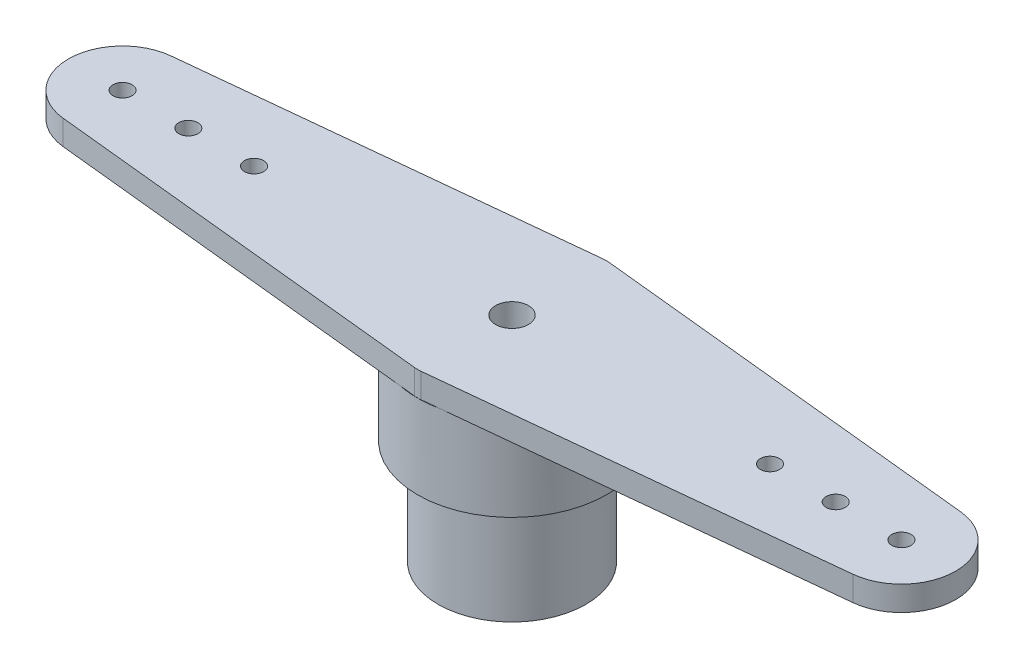
ISO-10303-21;
HEADER;
FILE_DESCRIPTION(('STEP AP214'),'2;1');
FILE_NAME('part.step','',(''),(''),'','','');
FILE_SCHEMA(('AUTOMOTIVE_DESIGN { 1 0 10303 214 1 1 1 1 }'));
ENDSEC;
DATA;
#1=APPLICATION_CONTEXT('core data for automotive mechanical design processes');
#2=APPLICATION_PROTOCOL_DEFINITION('international standard','automotive_design',2000,#1);
#3=PRODUCT_CONTEXT('',#1,'mechanical');
#4=PRODUCT('Part','Part','',(#3));
#5=PRODUCT_RELATED_PRODUCT_CATEGORY('part','',(#4));
#6=PRODUCT_DEFINITION_FORMATION('','',#4);
#7=PRODUCT_DEFINITION_CONTEXT('part definition',#1,'design');
#8=PRODUCT_DEFINITION('design','',#6,#7);
#9=PRODUCT_DEFINITION_SHAPE('','',#8);
#10=(LENGTH_UNIT() NAMED_UNIT(*) SI_UNIT(.MILLI.,.METRE.));
#11=(NAMED_UNIT(*) PLANE_ANGLE_UNIT() SI_UNIT($,.RADIAN.));
#12=(NAMED_UNIT(*) SI_UNIT($,.STERADIAN.) SOLID_ANGLE_UNIT());
#13=UNCERTAINTY_MEASURE_WITH_UNIT(LENGTH_MEASURE(1.E-05),#10,'distance_accuracy_value','');
#14=(GEOMETRIC_REPRESENTATION_CONTEXT(3) GLOBAL_UNCERTAINTY_ASSIGNED_CONTEXT((#13)) GLOBAL_UNIT_ASSIGNED_CONTEXT((#10,
#11,#12)) REPRESENTATION_CONTEXT('',''));
#15=CARTESIAN_POINT('',(0.,0.,0.));
#16=DIRECTION('',(0.,0.,1.));
#17=DIRECTION('',(1.,0.,0.));
#18=AXIS2_PLACEMENT_3D('',#15,#16,#17);
#19=CARTESIAN_POINT('',(0.,-2.55,0.));
#20=DIRECTION('',(0.,1.,0.));
#21=DIRECTION('',(0.,0.,1.));
#22=AXIS2_PLACEMENT_3D('',#19,#20,#21);
#23=PLANE('',#22);
#24=CARTESIAN_POINT('',(0.,-2.55,0.));
#25=DIRECTION('',(0.,1.,0.));
#26=DIRECTION('',(0.,0.,1.));
#27=AXIS2_PLACEMENT_3D('',#24,#25,#26);
#28=CIRCLE('',#27,2.875);
#29=CARTESIAN_POINT('',(0.,-2.55,2.875));
#30=VERTEX_POINT('',#29);
#31=EDGE_CURVE('E213',#30,#30,#28,.T.);
#32=ORIENTED_EDGE('',*,*,#31,.F.);
#33=EDGE_LOOP('',(#32));
#34=FACE_BOUND('',#33,.T.);
#35=CARTESIAN_POINT('',(0.,-2.55,0.));
#36=DIRECTION('',(0.,1.,0.));
#37=DIRECTION('',(0.,0.,1.));
#38=AXIS2_PLACEMENT_3D('',#35,#36,#37);
#39=CIRCLE('',#38,2.25);
#40=CARTESIAN_POINT('',(0.,-2.55,2.25));
#41=VERTEX_POINT('',#40);
#42=EDGE_CURVE('E220',#41,#41,#39,.F.);
#43=ORIENTED_EDGE('',*,*,#42,.F.);
#44=EDGE_LOOP('',(#43));
#45=FACE_BOUND('',#44,.T.);
#46=ADVANCED_FACE('F36',(#34,#45),#23,.F.);
#47=CARTESIAN_POINT('',(0.,0.,0.));
#48=DIRECTION('',(0.,1.,0.));
#49=DIRECTION('',(0.,0.,1.));
#50=AXIS2_PLACEMENT_3D('',#47,#48,#49);
#51=PLANE('',#50);
#52=CARTESIAN_POINT('',(0.,0.,0.));
#53=DIRECTION('',(0.,1.,0.));
#54=DIRECTION('',(0.,0.,1.));
#55=AXIS2_PLACEMENT_3D('',#52,#53,#54);
#56=CIRCLE('',#55,2.875);
#57=CARTESIAN_POINT('',(0.,0.,-2.875));
#58=VERTEX_POINT('',#57);
#59=CARTESIAN_POINT('',(-0.584049273257423,0.,-2.81505087812059));
#60=VERTEX_POINT('',#59);
#61=EDGE_CURVE('E262',#58,#60,#56,.T.);
#62=ORIENTED_EDGE('',*,*,#61,.T.);
#63=DIRECTION('',(0.994773374070749,0.,-0.102107464173283));
#64=VECTOR('',#63,1.);
#65=CARTESIAN_POINT('',(-0.292024636628711,0.,-2.84502543906029));
#66=LINE('',#65,#64);
#67=CARTESIAN_POINT('',(-0.102107464173283,0.,-2.86451928699375));
#68=VERTEX_POINT('',#67);
#69=EDGE_CURVE('E186',#60,#68,#66,.T.);
#70=ORIENTED_EDGE('',*,*,#69,.T.);
#71=CARTESIAN_POINT('',(0.,0.,-1.869745912923));
#72=DIRECTION('',(0.,1.,0.));
#73=DIRECTION('',(0.,0.,1.));
#74=AXIS2_PLACEMENT_3D('',#71,#72,#73);
#75=CIRCLE('',#74,1.);
#76=CARTESIAN_POINT('',(0.102107464173283,0.,-2.86451928699375));
#77=VERTEX_POINT('',#76);
#78=EDGE_CURVE('E11',#68,#77,#75,.F.);
#79=ORIENTED_EDGE('',*,*,#78,.T.);
#80=DIRECTION('',(-0.994773374070749,0.,-0.102107464173283));
#81=VECTOR('',#80,1.);
#82=CARTESIAN_POINT('',(0.292024636628711,0.,-2.84502543906029));
#83=LINE('',#82,#81);
#84=CARTESIAN_POINT('',(0.584049273257423,0.,-2.81505087812059));
#85=VERTEX_POINT('',#84);
#86=EDGE_CURVE('E51',#85,#77,#83,.T.);
#87=ORIENTED_EDGE('',*,*,#86,.F.);
#88=EDGE_CURVE('E264',#85,#58,#56,.T.);
#89=ORIENTED_EDGE('',*,*,#88,.T.);
#90=EDGE_LOOP('',(#62,#70,#79,#87,#89));
#91=FACE_BOUND('',#90,.T.);
#92=ADVANCED_FACE('F260',(#91),#51,.T.);
#93=CARTESIAN_POINT('',(0.,0.,2.875));
#94=VERTEX_POINT('',#93);
#95=CARTESIAN_POINT('',(0.584049273257423,0.,2.81505087812059));
#96=VERTEX_POINT('',#95);
#97=EDGE_CURVE('E216',#94,#96,#56,.T.);
#98=ORIENTED_EDGE('',*,*,#97,.T.);
#99=DIRECTION('',(-0.994773374070749,0.,0.102107464173283));
#100=VECTOR('',#99,1.);
#101=CARTESIAN_POINT('',(0.292024636628711,0.,2.84502543906029));
#102=LINE('',#101,#100);
#103=CARTESIAN_POINT('',(0.102107464173283,0.,2.86451928699375));
#104=VERTEX_POINT('',#103);
#105=EDGE_CURVE('E194',#96,#104,#102,.T.);
#106=ORIENTED_EDGE('',*,*,#105,.T.);
#107=CARTESIAN_POINT('',(0.,0.,1.869745912923));
#108=DIRECTION('',(0.,1.,0.));
#109=DIRECTION('',(0.,0.,1.));
#110=AXIS2_PLACEMENT_3D('',#107,#108,#109);
#111=CIRCLE('',#110,1.);
#112=CARTESIAN_POINT('',(-0.102107464173283,0.,2.86451928699375));
#113=VERTEX_POINT('',#112);
#114=EDGE_CURVE('E44',#104,#113,#111,.F.);
#115=ORIENTED_EDGE('',*,*,#114,.T.);
#116=DIRECTION('',(0.994773374070749,0.,0.102107464173283));
#117=VECTOR('',#116,1.);
#118=CARTESIAN_POINT('',(-0.292024636628711,0.,2.84502543906029));
#119=LINE('',#118,#117);
#120=CARTESIAN_POINT('',(-0.584049273257423,0.,2.81505087812059));
#121=VERTEX_POINT('',#120);
#122=EDGE_CURVE('E58',#121,#113,#119,.T.);
#123=ORIENTED_EDGE('',*,*,#122,.F.);
#124=EDGE_CURVE('E131',#121,#94,#56,.T.);
#125=ORIENTED_EDGE('',*,*,#124,.T.);
#126=EDGE_LOOP('',(#98,#106,#115,#123,#125));
#127=FACE_BOUND('',#126,.T.);
#128=ADVANCED_FACE('F237',(#127),#51,.T.);
#129=CARTESIAN_POINT('',(0.,-2.55,0.));
#130=DIRECTION('',(0.,1.,0.));
#131=DIRECTION('',(0.,0.,1.));
#132=AXIS2_PLACEMENT_3D('',#129,#130,#131);
#133=CYLINDRICAL_SURFACE('',#132,2.875);
#134=ORIENTED_EDGE('',*,*,#31,.T.);
#135=EDGE_LOOP('',(#134));
#136=FACE_BOUND('',#135,.T.);
#137=ORIENTED_EDGE('',*,*,#97,.F.);
#138=ORIENTED_EDGE('',*,*,#124,.F.);
#139=EDGE_CURVE('E266',#60,#121,#56,.T.);
#140=ORIENTED_EDGE('',*,*,#139,.F.);
#141=ORIENTED_EDGE('',*,*,#61,.F.);
#142=ORIENTED_EDGE('',*,*,#88,.F.);
#143=EDGE_CURVE('E219',#96,#85,#56,.T.);
#144=ORIENTED_EDGE('',*,*,#143,.F.);
#145=EDGE_LOOP('',(#137,#138,#140,#141,#142,#144));
#146=FACE_BOUND('',#145,.T.);
#147=ADVANCED_FACE('F269',(#136,#146),#133,.T.);
#148=CARTESIAN_POINT('',(0.,0.,0.));
#149=DIRECTION('',(0.,1.,0.));
#150=DIRECTION('',(0.,0.,1.));
#151=AXIS2_PLACEMENT_3D('',#148,#149,#150);
#152=PLANE('',#151);
#153=CARTESIAN_POINT('',(11.85,0.,0.));
#154=DIRECTION('',(0.,1.,0.));
#155=DIRECTION('',(0.,0.,1.));
#156=AXIS2_PLACEMENT_3D('',#153,#154,#155);
#157=CIRCLE('',#156,0.291434633875756);
#158=CARTESIAN_POINT('',(11.85,0.,0.291434633875756));
#159=VERTEX_POINT('',#158);
#160=EDGE_CURVE('E205',#159,#159,#157,.F.);
#161=ORIENTED_EDGE('',*,*,#160,.F.);
#162=EDGE_LOOP('',(#161));
#163=FACE_BOUND('',#162,.T.);
#164=CARTESIAN_POINT('',(7.85,0.,0.));
#165=DIRECTION('',(0.,1.,0.));
#166=DIRECTION('',(0.,0.,1.));
#167=AXIS2_PLACEMENT_3D('',#164,#165,#166);
#168=CIRCLE('',#167,0.291434633875755);
#169=CARTESIAN_POINT('',(7.85,0.,0.291434633875755));
#170=VERTEX_POINT('',#169);
#171=EDGE_CURVE('E202',#170,#170,#168,.F.);
#172=ORIENTED_EDGE('',*,*,#171,.F.);
#173=EDGE_LOOP('',(#172));
#174=FACE_BOUND('',#173,.T.);
#175=CARTESIAN_POINT('',(9.85,0.,0.));
#176=DIRECTION('',(0.,1.,0.));
#177=DIRECTION('',(0.,0.,1.));
#178=AXIS2_PLACEMENT_3D('',#175,#176,#177);
#179=CIRCLE('',#178,0.291434633875755);
#180=CARTESIAN_POINT('',(9.85,0.,0.291434633875755));
#181=VERTEX_POINT('',#180);
#182=EDGE_CURVE('E199',#181,#181,#179,.F.);
#183=ORIENTED_EDGE('',*,*,#182,.F.);
#184=EDGE_LOOP('',(#183));
#185=FACE_BOUND('',#184,.T.);
#186=CARTESIAN_POINT('',(12.0184773158859,0.,1.64137606721674));
#187=VERTEX_POINT('',#186);
#188=EDGE_CURVE('E190',#187,#96,#102,.T.);
#189=ORIENTED_EDGE('',*,*,#188,.T.);
#190=ORIENTED_EDGE('',*,*,#143,.T.);
#191=CARTESIAN_POINT('',(12.0184773158859,0.,-1.64137606721674));
#192=VERTEX_POINT('',#191);
#193=EDGE_CURVE('E197',#192,#85,#83,.T.);
#194=ORIENTED_EDGE('',*,*,#193,.F.);
#195=CARTESIAN_POINT('',(11.85,0.,0.));
#196=DIRECTION('',(0.,1.,0.));
#197=DIRECTION('',(0.,0.,1.));
#198=AXIS2_PLACEMENT_3D('',#195,#196,#197);
#199=CIRCLE('',#198,1.65);
#200=EDGE_CURVE('E193',#192,#187,#199,.F.);
#201=ORIENTED_EDGE('',*,*,#200,.T.);
#202=EDGE_LOOP('',(#189,#190,#194,#201));
#203=FACE_BOUND('',#202,.T.);
#204=ADVANCED_FACE('F273',(#163,#174,#185,#203),#152,.F.);
#205=CARTESIAN_POINT('',(-11.85,0.,0.));
#206=DIRECTION('',(0.,1.,0.));
#207=DIRECTION('',(0.,0.,1.));
#208=AXIS2_PLACEMENT_3D('',#205,#206,#207);
#209=CIRCLE('',#208,0.291434633875756);
#210=CARTESIAN_POINT('',(-11.85,0.,0.291434633875756));
#211=VERTEX_POINT('',#210);
#212=EDGE_CURVE('E181',#211,#211,#209,.T.);
#213=ORIENTED_EDGE('',*,*,#212,.T.);
#214=EDGE_LOOP('',(#213));
#215=FACE_BOUND('',#214,.T.);
#216=CARTESIAN_POINT('',(-9.85,0.,0.));
#217=DIRECTION('',(0.,1.,0.));
#218=DIRECTION('',(0.,0.,1.));
#219=AXIS2_PLACEMENT_3D('',#216,#217,#218);
#220=CIRCLE('',#219,0.291434633875755);
#221=CARTESIAN_POINT('',(-9.85,0.,0.291434633875755));
#222=VERTEX_POINT('',#221);
#223=EDGE_CURVE('E177',#222,#222,#220,.T.);
#224=ORIENTED_EDGE('',*,*,#223,.T.);
#225=EDGE_LOOP('',(#224));
#226=FACE_BOUND('',#225,.T.);
#227=CARTESIAN_POINT('',(-7.85,0.,0.));
#228=DIRECTION('',(0.,1.,0.));
#229=DIRECTION('',(0.,0.,1.));
#230=AXIS2_PLACEMENT_3D('',#227,#228,#229);
#231=CIRCLE('',#230,0.291434633875755);
#232=CARTESIAN_POINT('',(-7.85,0.,0.291434633875755));
#233=VERTEX_POINT('',#232);
#234=EDGE_CURVE('E174',#233,#233,#231,.T.);
#235=ORIENTED_EDGE('',*,*,#234,.T.);
#236=EDGE_LOOP('',(#235));
#237=FACE_BOUND('',#236,.T.);
#238=CARTESIAN_POINT('',(-12.0184773158859,0.,-1.64137606721674));
#239=VERTEX_POINT('',#238);
#240=EDGE_CURVE('E127',#239,#60,#66,.T.);
#241=ORIENTED_EDGE('',*,*,#240,.T.);
#242=ORIENTED_EDGE('',*,*,#139,.T.);
#243=CARTESIAN_POINT('',(-12.0184773158859,0.,1.64137606721674));
#244=VERTEX_POINT('',#243);
#245=EDGE_CURVE('E188',#244,#121,#119,.T.);
#246=ORIENTED_EDGE('',*,*,#245,.F.);
#247=CARTESIAN_POINT('',(-11.85,0.,0.));
#248=DIRECTION('',(0.,1.,0.));
#249=DIRECTION('',(0.,0.,1.));
#250=AXIS2_PLACEMENT_3D('',#247,#248,#249);
#251=CIRCLE('',#250,1.65);
#252=EDGE_CURVE('E185',#239,#244,#251,.T.);
#253=ORIENTED_EDGE('',*,*,#252,.F.);
#254=EDGE_LOOP('',(#241,#242,#246,#253));
#255=FACE_BOUND('',#254,.T.);
#256=ADVANCED_FACE('F332',(#215,#226,#237,#255),#152,.F.);
#257=CARTESIAN_POINT('',(-0.292024636628711,0.75,-2.84502543906029));
#258=DIRECTION('',(-0.102107464173283,0.,-0.994773374070749));
#259=DIRECTION('',(-0.994773374070749,0.,0.102107464173283));
#260=AXIS2_PLACEMENT_3D('',#257,#258,#259);
#261=PLANE('',#260);
#262=DIRECTION('',(0.994773374070749,0.,-0.102107464173283));
#263=VECTOR('',#262,1.);
#264=CARTESIAN_POINT('',(-0.292024636628711,0.75,-2.84502543906029));
#265=LINE('',#264,#263);
#266=CARTESIAN_POINT('',(-12.0184773158859,0.75,-1.64137606721674));
#267=VERTEX_POINT('',#266);
#268=CARTESIAN_POINT('',(-0.102107464173283,0.75,-2.86451928699375));
#269=VERTEX_POINT('',#268);
#270=EDGE_CURVE('E123',#267,#269,#265,.T.);
#271=ORIENTED_EDGE('',*,*,#270,.T.);
#272=DIRECTION('',(0.,-1.,0.));
#273=VECTOR('',#272,1.);
#274=CARTESIAN_POINT('',(-0.102107464173283,0.,-2.86451928699375));
#275=LINE('',#274,#273);
#276=EDGE_CURVE('E231',#269,#68,#275,.T.);
#277=ORIENTED_EDGE('',*,*,#276,.T.);
#278=ORIENTED_EDGE('',*,*,#69,.F.);
#279=ORIENTED_EDGE('',*,*,#240,.F.);
#280=DIRECTION('',(0.,-1.,0.));
#281=VECTOR('',#280,1.);
#282=CARTESIAN_POINT('',(-12.0184773158859,0.75,-1.64137606721674));
#283=LINE('',#282,#281);
#284=EDGE_CURVE('E118',#267,#239,#283,.T.);
#285=ORIENTED_EDGE('',*,*,#284,.F.);
#286=EDGE_LOOP('',(#271,#277,#278,#279,#285));
#287=FACE_BOUND('',#286,.T.);
#288=ADVANCED_FACE('F120',(#287),#261,.T.);
#289=CARTESIAN_POINT('',(-11.85,0.75,0.));
#290=DIRECTION('',(0.,-1.,0.));
#291=DIRECTION('',(0.,0.,-1.));
#292=AXIS2_PLACEMENT_3D('',#289,#290,#291);
#293=CYLINDRICAL_SURFACE('',#292,1.65);
#294=ORIENTED_EDGE('',*,*,#252,.T.);
#295=DIRECTION('',(0.,-1.,0.));
#296=VECTOR('',#295,1.);
#297=CARTESIAN_POINT('',(-12.0184773158859,0.75,1.64137606721674));
#298=LINE('',#297,#296);
#299=CARTESIAN_POINT('',(-12.0184773158859,0.75,1.64137606721674));
#300=VERTEX_POINT('',#299);
#301=EDGE_CURVE('E132',#300,#244,#298,.T.);
#302=ORIENTED_EDGE('',*,*,#301,.F.);
#303=CARTESIAN_POINT('',(-11.85,0.75,0.));
#304=DIRECTION('',(0.,1.,0.));
#305=DIRECTION('',(0.,0.,1.));
#306=AXIS2_PLACEMENT_3D('',#303,#304,#305);
#307=CIRCLE('',#306,1.65);
#308=EDGE_CURVE('E136',#267,#300,#307,.T.);
#309=ORIENTED_EDGE('',*,*,#308,.F.);
#310=ORIENTED_EDGE('',*,*,#284,.T.);
#311=EDGE_LOOP('',(#294,#302,#309,#310));
#312=FACE_BOUND('',#311,.T.);
#313=ADVANCED_FACE('F137',(#312),#293,.T.);
#314=CARTESIAN_POINT('',(-0.292024636628711,0.75,2.84502543906029));
#315=DIRECTION('',(0.102107464173283,0.,-0.994773374070749));
#316=DIRECTION('',(-0.994773374070749,0.,-0.102107464173283));
#317=AXIS2_PLACEMENT_3D('',#314,#315,#316);
#318=PLANE('',#317);
#319=ORIENTED_EDGE('',*,*,#122,.T.);
#320=DIRECTION('',(0.,-1.,0.));
#321=VECTOR('',#320,1.);
#322=CARTESIAN_POINT('',(-0.102107464173283,0.75,2.86451928699375));
#323=LINE('',#322,#321);
#324=CARTESIAN_POINT('',(-0.102107464173283,0.75,2.86451928699375));
#325=VERTEX_POINT('',#324);
#326=EDGE_CURVE('E226',#113,#325,#323,.F.);
#327=ORIENTED_EDGE('',*,*,#326,.T.);
#328=DIRECTION('',(0.994773374070749,0.,0.102107464173283));
#329=VECTOR('',#328,1.);
#330=CARTESIAN_POINT('',(-0.292024636628711,0.75,2.84502543906029));
#331=LINE('',#330,#329);
#332=EDGE_CURVE('E141',#300,#325,#331,.T.);
#333=ORIENTED_EDGE('',*,*,#332,.F.);
#334=ORIENTED_EDGE('',*,*,#301,.T.);
#335=ORIENTED_EDGE('',*,*,#245,.T.);
#336=EDGE_LOOP('',(#319,#327,#333,#334,#335));
#337=FACE_BOUND('',#336,.T.);
#338=ADVANCED_FACE('F245',(#337),#318,.F.);
#339=CARTESIAN_POINT('',(0.292024636628711,0.75,2.84502543906029));
#340=DIRECTION('',(0.102107464173283,0.,0.994773374070749));
#341=DIRECTION('',(0.994773374070749,0.,-0.102107464173283));
#342=AXIS2_PLACEMENT_3D('',#339,#340,#341);
#343=PLANE('',#342);
#344=DIRECTION('',(-0.994773374070749,0.,0.102107464173283));
#345=VECTOR('',#344,1.);
#346=CARTESIAN_POINT('',(0.292024636628711,0.75,2.84502543906029));
#347=LINE('',#346,#345);
#348=CARTESIAN_POINT('',(12.0184773158859,0.75,1.64137606721674));
#349=VERTEX_POINT('',#348);
#350=CARTESIAN_POINT('',(0.102107464173283,0.75,2.86451928699375));
#351=VERTEX_POINT('',#350);
#352=EDGE_CURVE('E156',#349,#351,#347,.T.);
#353=ORIENTED_EDGE('',*,*,#352,.T.);
#354=DIRECTION('',(0.,-1.,0.));
#355=VECTOR('',#354,1.);
#356=CARTESIAN_POINT('',(0.102107464173283,0.,2.86451928699375));
#357=LINE('',#356,#355);
#358=EDGE_CURVE('E223',#351,#104,#357,.T.);
#359=ORIENTED_EDGE('',*,*,#358,.T.);
#360=ORIENTED_EDGE('',*,*,#105,.F.);
#361=ORIENTED_EDGE('',*,*,#188,.F.);
#362=DIRECTION('',(0.,-1.,0.));
#363=VECTOR('',#362,1.);
#364=CARTESIAN_POINT('',(12.0184773158859,0.75,1.64137606721674));
#365=LINE('',#364,#363);
#366=EDGE_CURVE('E210',#349,#187,#365,.T.);
#367=ORIENTED_EDGE('',*,*,#366,.F.);
#368=EDGE_LOOP('',(#353,#359,#360,#361,#367));
#369=FACE_BOUND('',#368,.T.);
#370=ADVANCED_FACE('F249',(#369),#343,.T.);
#371=CARTESIAN_POINT('',(11.85,0.75,0.));
#372=DIRECTION('',(0.,-1.,0.));
#373=DIRECTION('',(0.,0.,-1.));
#374=AXIS2_PLACEMENT_3D('',#371,#372,#373);
#375=CYLINDRICAL_SURFACE('',#374,1.65);
#376=ORIENTED_EDGE('',*,*,#200,.F.);
#377=DIRECTION('',(0.,-1.,0.));
#378=VECTOR('',#377,1.);
#379=CARTESIAN_POINT('',(12.0184773158859,0.75,-1.64137606721674));
#380=LINE('',#379,#378);
#381=CARTESIAN_POINT('',(12.0184773158859,0.75,-1.64137606721674));
#382=VERTEX_POINT('',#381);
#383=EDGE_CURVE('E173',#382,#192,#380,.T.);
#384=ORIENTED_EDGE('',*,*,#383,.F.);
#385=CARTESIAN_POINT('',(11.85,0.75,0.));
#386=DIRECTION('',(0.,1.,0.));
#387=DIRECTION('',(0.,0.,1.));
#388=AXIS2_PLACEMENT_3D('',#385,#386,#387);
#389=CIRCLE('',#388,1.65);
#390=EDGE_CURVE('E159',#382,#349,#389,.F.);
#391=ORIENTED_EDGE('',*,*,#390,.T.);
#392=ORIENTED_EDGE('',*,*,#366,.T.);
#393=EDGE_LOOP('',(#376,#384,#391,#392));
#394=FACE_BOUND('',#393,.T.);
#395=ADVANCED_FACE('F253',(#394),#375,.T.);
#396=CARTESIAN_POINT('',(7.85,0.75,0.));
#397=DIRECTION('',(0.,-1.,0.));
#398=DIRECTION('',(0.,0.,-1.));
#399=AXIS2_PLACEMENT_3D('',#396,#397,#398);
#400=CYLINDRICAL_SURFACE('',#399,0.291434633875755);
#401=CARTESIAN_POINT('',(7.85,0.75,0.));
#402=DIRECTION('',(0.,1.,0.));
#403=DIRECTION('',(0.,0.,1.));
#404=AXIS2_PLACEMENT_3D('',#401,#402,#403);
#405=CIRCLE('',#404,0.291434633875755);
#406=CARTESIAN_POINT('',(7.85,0.75,0.291434633875755));
#407=VERTEX_POINT('',#406);
#408=EDGE_CURVE('E167',#407,#407,#405,.F.);
#409=ORIENTED_EDGE('',*,*,#408,.F.);
#410=EDGE_LOOP('',(#409));
#411=FACE_BOUND('',#410,.T.);
#412=ORIENTED_EDGE('',*,*,#171,.T.);
#413=EDGE_LOOP('',(#412));
#414=FACE_BOUND('',#413,.T.);
#415=ADVANCED_FACE('F286',(#411,#414),#400,.F.);
#416=CARTESIAN_POINT('',(9.85,0.75,0.));
#417=DIRECTION('',(0.,-1.,0.));
#418=DIRECTION('',(0.,0.,-1.));
#419=AXIS2_PLACEMENT_3D('',#416,#417,#418);
#420=CYLINDRICAL_SURFACE('',#419,0.291434633875755);
#421=CARTESIAN_POINT('',(9.85,0.75,0.));
#422=DIRECTION('',(0.,1.,0.));
#423=DIRECTION('',(0.,0.,1.));
#424=AXIS2_PLACEMENT_3D('',#421,#422,#423);
#425=CIRCLE('',#424,0.291434633875755);
#426=CARTESIAN_POINT('',(9.85,0.75,0.291434633875755));
#427=VERTEX_POINT('',#426);
#428=EDGE_CURVE('E164',#427,#427,#425,.F.);
#429=ORIENTED_EDGE('',*,*,#428,.F.);
#430=EDGE_LOOP('',(#429));
#431=FACE_BOUND('',#430,.T.);
#432=ORIENTED_EDGE('',*,*,#182,.T.);
#433=EDGE_LOOP('',(#432));
#434=FACE_BOUND('',#433,.T.);
#435=ADVANCED_FACE('F277',(#431,#434),#420,.F.);
#436=CARTESIAN_POINT('',(0.292024636628711,0.75,-2.84502543906029));
#437=DIRECTION('',(-0.102107464173283,0.,0.994773374070749));
#438=DIRECTION('',(0.994773374070749,0.,0.102107464173283));
#439=AXIS2_PLACEMENT_3D('',#436,#437,#438);
#440=PLANE('',#439);
#441=ORIENTED_EDGE('',*,*,#86,.T.);
#442=DIRECTION('',(0.,-1.,0.));
#443=VECTOR('',#442,1.);
#444=CARTESIAN_POINT('',(0.102107464173283,0.75,-2.86451928699375));
#445=LINE('',#444,#443);
#446=CARTESIAN_POINT('',(0.102107464173283,0.75,-2.86451928699375));
#447=VERTEX_POINT('',#446);
#448=EDGE_CURVE('E233',#77,#447,#445,.F.);
#449=ORIENTED_EDGE('',*,*,#448,.T.);
#450=DIRECTION('',(-0.994773374070749,0.,-0.102107464173283));
#451=VECTOR('',#450,1.);
#452=CARTESIAN_POINT('',(0.292024636628711,0.75,-2.84502543906029));
#453=LINE('',#452,#451);
#454=EDGE_CURVE('E162',#382,#447,#453,.T.);
#455=ORIENTED_EDGE('',*,*,#454,.F.);
#456=ORIENTED_EDGE('',*,*,#383,.T.);
#457=ORIENTED_EDGE('',*,*,#193,.T.);
#458=EDGE_LOOP('',(#441,#449,#455,#456,#457));
#459=FACE_BOUND('',#458,.T.);
#460=ADVANCED_FACE('F274',(#459),#440,.F.);
#461=CARTESIAN_POINT('',(-11.85,0.75,0.));
#462=DIRECTION('',(0.,-1.,0.));
#463=DIRECTION('',(0.,0.,-1.));
#464=AXIS2_PLACEMENT_3D('',#461,#462,#463);
#465=CYLINDRICAL_SURFACE('',#464,0.291434633875756);
#466=CARTESIAN_POINT('',(-11.85,0.75,0.));
#467=DIRECTION('',(0.,1.,0.));
#468=DIRECTION('',(0.,0.,1.));
#469=AXIS2_PLACEMENT_3D('',#466,#467,#468);
#470=CIRCLE('',#469,0.291434633875756);
#471=CARTESIAN_POINT('',(-11.85,0.75,0.291434633875756));
#472=VERTEX_POINT('',#471);
#473=EDGE_CURVE('E148',#472,#472,#470,.T.);
#474=ORIENTED_EDGE('',*,*,#473,.T.);
#475=EDGE_LOOP('',(#474));
#476=FACE_BOUND('',#475,.T.);
#477=ORIENTED_EDGE('',*,*,#212,.F.);
#478=EDGE_LOOP('',(#477));
#479=FACE_BOUND('',#478,.T.);
#480=ADVANCED_FACE('F276',(#476,#479),#465,.F.);
#481=CARTESIAN_POINT('',(-9.85,0.75,0.));
#482=DIRECTION('',(0.,-1.,0.));
#483=DIRECTION('',(0.,0.,-1.));
#484=AXIS2_PLACEMENT_3D('',#481,#482,#483);
#485=CYLINDRICAL_SURFACE('',#484,0.291434633875755);
#486=CARTESIAN_POINT('',(-9.85,0.75,0.));
#487=DIRECTION('',(0.,1.,0.));
#488=DIRECTION('',(0.,0.,1.));
#489=AXIS2_PLACEMENT_3D('',#486,#487,#488);
#490=CIRCLE('',#489,0.291434633875755);
#491=CARTESIAN_POINT('',(-9.85,0.75,0.291434633875755));
#492=VERTEX_POINT('',#491);
#493=EDGE_CURVE('E151',#492,#492,#490,.T.);
#494=ORIENTED_EDGE('',*,*,#493,.T.);
#495=EDGE_LOOP('',(#494));
#496=FACE_BOUND('',#495,.T.);
#497=ORIENTED_EDGE('',*,*,#223,.F.);
#498=EDGE_LOOP('',(#497));
#499=FACE_BOUND('',#498,.T.);
#500=ADVANCED_FACE('F283',(#496,#499),#485,.F.);
#501=CARTESIAN_POINT('',(-7.85,0.75,0.));
#502=DIRECTION('',(0.,-1.,0.));
#503=DIRECTION('',(0.,0.,-1.));
#504=AXIS2_PLACEMENT_3D('',#501,#502,#503);
#505=CYLINDRICAL_SURFACE('',#504,0.291434633875755);
#506=CARTESIAN_POINT('',(-7.85,0.75,0.));
#507=DIRECTION('',(0.,1.,0.));
#508=DIRECTION('',(0.,0.,1.));
#509=AXIS2_PLACEMENT_3D('',#506,#507,#508);
#510=CIRCLE('',#509,0.291434633875755);
#511=CARTESIAN_POINT('',(-7.85,0.75,0.291434633875755));
#512=VERTEX_POINT('',#511);
#513=EDGE_CURVE('E208',#512,#512,#510,.T.);
#514=ORIENTED_EDGE('',*,*,#513,.T.);
#515=EDGE_LOOP('',(#514));
#516=FACE_BOUND('',#515,.T.);
#517=ORIENTED_EDGE('',*,*,#234,.F.);
#518=EDGE_LOOP('',(#517));
#519=FACE_BOUND('',#518,.T.);
#520=ADVANCED_FACE('F300',(#516,#519),#505,.F.);
#521=CARTESIAN_POINT('',(11.85,0.75,0.));
#522=DIRECTION('',(0.,-1.,0.));
#523=DIRECTION('',(0.,0.,-1.));
#524=AXIS2_PLACEMENT_3D('',#521,#522,#523);
#525=CYLINDRICAL_SURFACE('',#524,0.291434633875756);
#526=CARTESIAN_POINT('',(11.85,0.75,0.));
#527=DIRECTION('',(0.,1.,0.));
#528=DIRECTION('',(0.,0.,1.));
#529=AXIS2_PLACEMENT_3D('',#526,#527,#528);
#530=CIRCLE('',#529,0.291434633875756);
#531=CARTESIAN_POINT('',(11.85,0.75,0.291434633875756));
#532=VERTEX_POINT('',#531);
#533=EDGE_CURVE('E170',#532,#532,#530,.F.);
#534=ORIENTED_EDGE('',*,*,#533,.F.);
#535=EDGE_LOOP('',(#534));
#536=FACE_BOUND('',#535,.T.);
#537=ORIENTED_EDGE('',*,*,#160,.T.);
#538=EDGE_LOOP('',(#537));
#539=FACE_BOUND('',#538,.T.);
#540=ADVANCED_FACE('F328',(#536,#539),#525,.F.);
#541=CARTESIAN_POINT('',(0.,0.75,0.));
#542=DIRECTION('',(0.,1.,0.));
#543=DIRECTION('',(0.,0.,1.));
#544=AXIS2_PLACEMENT_3D('',#541,#542,#543);
#545=PLANE('',#544);
#546=CARTESIAN_POINT('',(0.,0.75,0.));
#547=DIRECTION('',(0.,-1.,0.));
#548=DIRECTION('',(0.,0.,-1.));
#549=AXIS2_PLACEMENT_3D('',#546,#547,#548);
#550=CIRCLE('',#549,0.5);
#551=CARTESIAN_POINT('',(0.,0.75,-0.5));
#552=VERTEX_POINT('',#551);
#553=EDGE_CURVE('E537',#552,#552,#550,.T.);
#554=ORIENTED_EDGE('',*,*,#553,.T.);
#555=EDGE_LOOP('',(#554));
#556=FACE_BOUND('',#555,.T.);
#557=ORIENTED_EDGE('',*,*,#513,.F.);
#558=EDGE_LOOP('',(#557));
#559=FACE_BOUND('',#558,.T.);
#560=ORIENTED_EDGE('',*,*,#493,.F.);
#561=EDGE_LOOP('',(#560));
#562=FACE_BOUND('',#561,.T.);
#563=ORIENTED_EDGE('',*,*,#473,.F.);
#564=EDGE_LOOP('',(#563));
#565=FACE_BOUND('',#564,.T.);
#566=ORIENTED_EDGE('',*,*,#332,.T.);
#567=CARTESIAN_POINT('',(0.,0.75,1.869745912923));
#568=DIRECTION('',(0.,1.,0.));
#569=DIRECTION('',(0.,0.,1.));
#570=AXIS2_PLACEMENT_3D('',#567,#568,#569);
#571=CIRCLE('',#570,1.);
#572=EDGE_CURVE('E229',#325,#351,#571,.T.);
#573=ORIENTED_EDGE('',*,*,#572,.T.);
#574=ORIENTED_EDGE('',*,*,#352,.F.);
#575=ORIENTED_EDGE('',*,*,#390,.F.);
#576=ORIENTED_EDGE('',*,*,#454,.T.);
#577=CARTESIAN_POINT('',(0.,0.75,-1.869745912923));
#578=DIRECTION('',(0.,1.,0.));
#579=DIRECTION('',(0.,0.,1.));
#580=AXIS2_PLACEMENT_3D('',#577,#578,#579);
#581=CIRCLE('',#580,1.);
#582=EDGE_CURVE('E147',#447,#269,#581,.T.);
#583=ORIENTED_EDGE('',*,*,#582,.T.);
#584=ORIENTED_EDGE('',*,*,#270,.F.);
#585=ORIENTED_EDGE('',*,*,#308,.T.);
#586=EDGE_LOOP('',(#566,#573,#574,#575,#576,#583,#584,#585));
#587=FACE_BOUND('',#586,.T.);
#588=ORIENTED_EDGE('',*,*,#428,.T.);
#589=EDGE_LOOP('',(#588));
#590=FACE_BOUND('',#589,.T.);
#591=ORIENTED_EDGE('',*,*,#408,.T.);
#592=EDGE_LOOP('',(#591));
#593=FACE_BOUND('',#592,.T.);
#594=ORIENTED_EDGE('',*,*,#533,.T.);
#595=EDGE_LOOP('',(#594));
#596=FACE_BOUND('',#595,.T.);
#597=ADVANCED_FACE('F143',(#556,#559,#562,#565,#587,#590,#593,#596),#545,.T.);
#598=CARTESIAN_POINT('',(0.,-5.75,0.));
#599=DIRECTION('',(0.,1.,0.));
#600=DIRECTION('',(0.,0.,1.));
#601=AXIS2_PLACEMENT_3D('',#598,#599,#600);
#602=CYLINDRICAL_SURFACE('',#601,2.25);
#603=CARTESIAN_POINT('',(0.,-5.75,0.));
#604=DIRECTION('',(0.,-1.,0.));
#605=DIRECTION('',(0.,0.,-1.));
#606=AXIS2_PLACEMENT_3D('',#603,#604,#605);
#607=CIRCLE('',#606,2.25);
#608=CARTESIAN_POINT('',(0.,-5.75,-2.25));
#609=VERTEX_POINT('',#608);
#610=EDGE_CURVE('E178',#609,#609,#607,.T.);
#611=ORIENTED_EDGE('',*,*,#610,.F.);
#612=EDGE_LOOP('',(#611));
#613=FACE_BOUND('',#612,.T.);
#614=ORIENTED_EDGE('',*,*,#42,.T.);
#615=EDGE_LOOP('',(#614));
#616=FACE_BOUND('',#615,.T.);
#617=ADVANCED_FACE('F317',(#613,#616),#602,.T.);
#618=CARTESIAN_POINT('',(0.,-5.75,0.));
#619=DIRECTION('',(0.,-1.,0.));
#620=DIRECTION('',(0.,0.,-1.));
#621=AXIS2_PLACEMENT_3D('',#618,#619,#620);
#622=PLANE('',#621);
#623=CARTESIAN_POINT('',(0.,-5.75,0.));
#624=DIRECTION('',(0.,-1.,0.));
#625=DIRECTION('',(0.,0.,-1.));
#626=AXIS2_PLACEMENT_3D('',#623,#624,#625);
#627=CIRCLE('',#626,0.5);
#628=CARTESIAN_POINT('',(0.,-5.75,-0.5));
#629=VERTEX_POINT('',#628);
#630=EDGE_CURVE('E538',#629,#629,#627,.T.);
#631=ORIENTED_EDGE('',*,*,#630,.F.);
#632=EDGE_LOOP('',(#631));
#633=FACE_BOUND('',#632,.T.);
#634=ORIENTED_EDGE('',*,*,#610,.T.);
#635=EDGE_LOOP('',(#634));
#636=FACE_BOUND('',#635,.T.);
#637=ADVANCED_FACE('F311',(#633,#636),#622,.T.);
#638=CARTESIAN_POINT('',(0.,0.75,0.));
#639=DIRECTION('',(0.,-1.,0.));
#640=DIRECTION('',(0.,0.,-1.));
#641=AXIS2_PLACEMENT_3D('',#638,#639,#640);
#642=CYLINDRICAL_SURFACE('',#641,0.5);
#643=ORIENTED_EDGE('',*,*,#553,.F.);
#644=EDGE_LOOP('',(#643));
#645=FACE_BOUND('',#644,.T.);
#646=ORIENTED_EDGE('',*,*,#630,.T.);
#647=EDGE_LOOP('',(#646));
#648=FACE_BOUND('',#647,.T.);
#649=ADVANCED_FACE('F306',(#645,#648),#642,.F.);
#650=CARTESIAN_POINT('',(0.,0.75,1.869745912923));
#651=DIRECTION('',(0.,1.,0.));
#652=DIRECTION('',(0.,0.,1.));
#653=AXIS2_PLACEMENT_3D('',#650,#651,#652);
#654=CYLINDRICAL_SURFACE('',#653,1.);
#655=ORIENTED_EDGE('',*,*,#572,.F.);
#656=ORIENTED_EDGE('',*,*,#326,.F.);
#657=ORIENTED_EDGE('',*,*,#114,.F.);
#658=ORIENTED_EDGE('',*,*,#358,.F.);
#659=EDGE_LOOP('',(#655,#656,#657,#658));
#660=FACE_BOUND('',#659,.T.);
#661=ADVANCED_FACE('F244',(#660),#654,.T.);
#662=CARTESIAN_POINT('',(0.,0.75,-1.869745912923));
#663=DIRECTION('',(0.,1.,0.));
#664=DIRECTION('',(0.,0.,1.));
#665=AXIS2_PLACEMENT_3D('',#662,#663,#664);
#666=CYLINDRICAL_SURFACE('',#665,1.);
#667=ORIENTED_EDGE('',*,*,#582,.F.);
#668=ORIENTED_EDGE('',*,*,#448,.F.);
#669=ORIENTED_EDGE('',*,*,#78,.F.);
#670=ORIENTED_EDGE('',*,*,#276,.F.);
#671=EDGE_LOOP('',(#667,#668,#669,#670));
#672=FACE_BOUND('',#671,.T.);
#673=ADVANCED_FACE('F38',(#672),#666,.T.);
#674=CLOSED_SHELL('',(#46,#92,#128,#147,#204,#256,#288,#313,#338,#370,#395,#415,#435,#460,#480,
#500,#520,#540,#597,#617,#637,#649,#661,#673));
#675=MANIFOLD_SOLID_BREP('B2',#674);
#676=ADVANCED_BREP_SHAPE_REPRESENTATION('',(#18,#675),#14);
#677=SHAPE_DEFINITION_REPRESENTATION(#9,#676);
ENDSEC;
END-ISO-10303-21;
